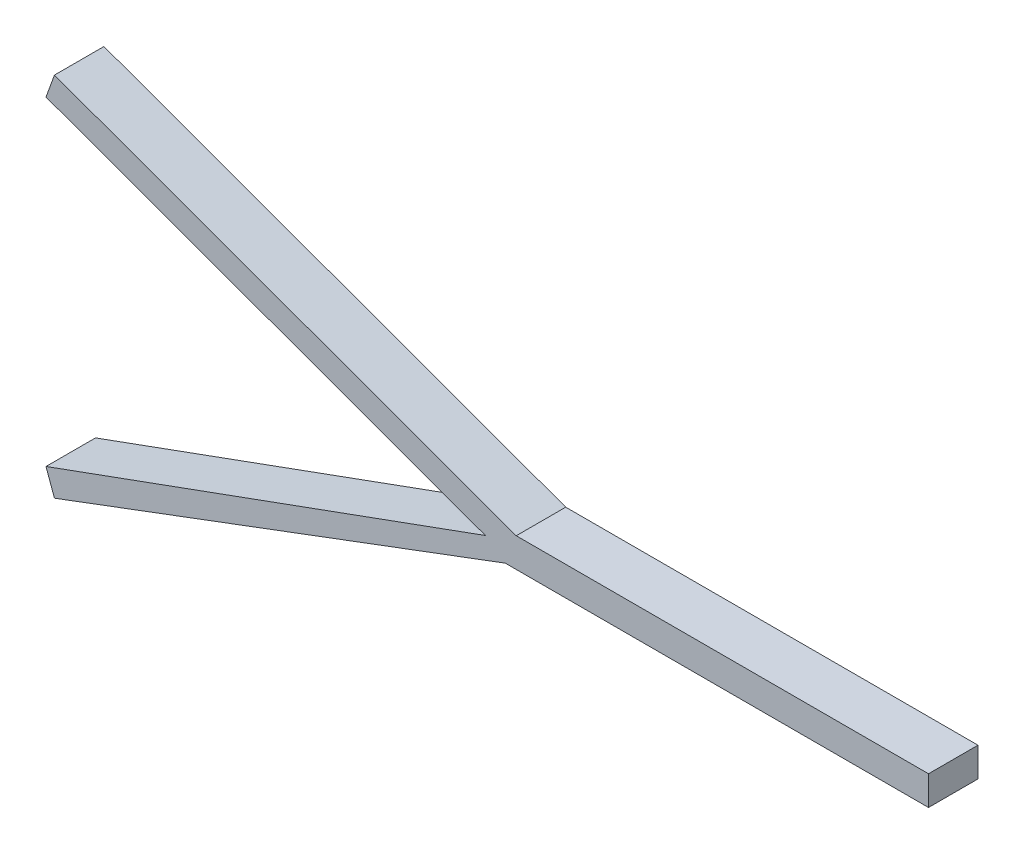
ISO-10303-21;
HEADER;
FILE_DESCRIPTION(('STEP AP214'),'2;1');
FILE_NAME('part.step','',(''),(''),'','','');
FILE_SCHEMA(('AUTOMOTIVE_DESIGN { 1 0 10303 214 1 1 1 1 }'));
ENDSEC;
DATA;
#1=APPLICATION_CONTEXT('core data for automotive mechanical design processes');
#2=APPLICATION_PROTOCOL_DEFINITION('international standard','automotive_design',2000,#1);
#3=PRODUCT_CONTEXT('',#1,'mechanical');
#4=PRODUCT('Part','Part','',(#3));
#5=PRODUCT_RELATED_PRODUCT_CATEGORY('part','',(#4));
#6=PRODUCT_DEFINITION_FORMATION('','',#4);
#7=PRODUCT_DEFINITION_CONTEXT('part definition',#1,'design');
#8=PRODUCT_DEFINITION('design','',#6,#7);
#9=PRODUCT_DEFINITION_SHAPE('','',#8);
#10=(LENGTH_UNIT() NAMED_UNIT(*) SI_UNIT(.MILLI.,.METRE.));
#11=(NAMED_UNIT(*) PLANE_ANGLE_UNIT() SI_UNIT($,.RADIAN.));
#12=(NAMED_UNIT(*) SI_UNIT($,.STERADIAN.) SOLID_ANGLE_UNIT());
#13=UNCERTAINTY_MEASURE_WITH_UNIT(LENGTH_MEASURE(1.E-05),#10,'distance_accuracy_value','');
#14=(GEOMETRIC_REPRESENTATION_CONTEXT(3) GLOBAL_UNCERTAINTY_ASSIGNED_CONTEXT((#13)) GLOBAL_UNIT_ASSIGNED_CONTEXT((#10,
#11,#12)) REPRESENTATION_CONTEXT('',''));
#15=CARTESIAN_POINT('',(0.,0.,0.));
#16=DIRECTION('',(0.,0.,1.));
#17=DIRECTION('',(1.,0.,0.));
#18=AXIS2_PLACEMENT_3D('',#15,#16,#17);
#19=CARTESIAN_POINT('',(-112.593637791252,45.0230125740432,10.));
#20=DIRECTION('',(0.93969262078591,-0.342020143325664,0.));
#21=DIRECTION('',(0.342020143325664,0.93969262078591,0.));
#22=AXIS2_PLACEMENT_3D('',#19,#20,#21);
#23=PLANE('',#22);
#24=DIRECTION('',(-0.342020143325664,-0.93969262078591,0.));
#25=VECTOR('',#24,1.);
#26=CARTESIAN_POINT('',(-112.593637791252,45.0230125740432,0.));
#27=LINE('',#26,#25);
#28=CARTESIAN_POINT('',(-112.593637791252,45.0230125740432,0.));
#29=VERTEX_POINT('',#28);
#30=CARTESIAN_POINT('',(-114.30373850788,40.3245494701136,0.));
#31=VERTEX_POINT('',#30);
#32=EDGE_CURVE('E146',#29,#31,#27,.T.);
#33=ORIENTED_EDGE('',*,*,#32,.T.);
#34=DIRECTION('',(0.,0.,-1.));
#35=VECTOR('',#34,1.);
#36=CARTESIAN_POINT('',(-114.30373850788,40.3245494701136,10.));
#37=LINE('',#36,#35);
#38=CARTESIAN_POINT('',(-114.30373850788,40.3245494701136,10.));
#39=VERTEX_POINT('',#38);
#40=EDGE_CURVE('E11',#39,#31,#37,.T.);
#41=ORIENTED_EDGE('',*,*,#40,.F.);
#42=DIRECTION('',(-0.342020143325664,-0.93969262078591,0.));
#43=VECTOR('',#42,1.);
#44=CARTESIAN_POINT('',(-112.593637791252,45.0230125740432,10.));
#45=LINE('',#44,#43);
#46=CARTESIAN_POINT('',(-112.593637791252,45.0230125740432,10.));
#47=VERTEX_POINT('',#46);
#48=EDGE_CURVE('E176',#47,#39,#45,.T.);
#49=ORIENTED_EDGE('',*,*,#48,.F.);
#50=DIRECTION('',(0.,0.,-1.));
#51=VECTOR('',#50,1.);
#52=CARTESIAN_POINT('',(-112.593637791252,45.0230125740432,10.));
#53=LINE('',#52,#51);
#54=EDGE_CURVE('E142',#47,#29,#53,.T.);
#55=ORIENTED_EDGE('',*,*,#54,.T.);
#56=EDGE_LOOP('',(#33,#41,#49,#55));
#57=FACE_BOUND('',#56,.T.);
#58=ADVANCED_FACE('F39',(#57),#23,.F.);
#59=CARTESIAN_POINT('',(-114.30373850788,40.3245494701136,10.));
#60=DIRECTION('',(0.342020143325663,0.939692620785911,0.));
#61=DIRECTION('',(-0.939692620785911,0.342020143325663,0.));
#62=AXIS2_PLACEMENT_3D('',#59,#60,#61);
#63=PLANE('',#62);
#64=DIRECTION('',(0.939692620785911,-0.342020143325663,0.));
#65=VECTOR('',#64,1.);
#66=CARTESIAN_POINT('',(-114.30373850788,40.3245494701136,0.));
#67=LINE('',#66,#65);
#68=CARTESIAN_POINT('',(-25.5005507087225,8.00283240326931,0.));
#69=VERTEX_POINT('',#68);
#70=EDGE_CURVE('E150',#31,#69,#67,.T.);
#71=ORIENTED_EDGE('',*,*,#70,.T.);
#72=DIRECTION('',(0.,0.,-1.));
#73=VECTOR('',#72,1.);
#74=CARTESIAN_POINT('',(-25.5005507087225,8.00283240326931,10.));
#75=LINE('',#74,#73);
#76=CARTESIAN_POINT('',(-25.5005507087225,8.00283240326931,10.));
#77=VERTEX_POINT('',#76);
#78=EDGE_CURVE('E48',#77,#69,#75,.T.);
#79=ORIENTED_EDGE('',*,*,#78,.F.);
#80=DIRECTION('',(0.939692620785911,-0.342020143325663,0.));
#81=VECTOR('',#80,1.);
#82=CARTESIAN_POINT('',(-114.30373850788,40.3245494701136,10.));
#83=LINE('',#82,#81);
#84=EDGE_CURVE('E98',#39,#77,#83,.T.);
#85=ORIENTED_EDGE('',*,*,#84,.F.);
#86=ORIENTED_EDGE('',*,*,#40,.T.);
#87=EDGE_LOOP('',(#71,#79,#85,#86));
#88=FACE_BOUND('',#87,.T.);
#89=ADVANCED_FACE('F198',(#88),#63,.F.);
#90=CARTESIAN_POINT('',(-114.30373850788,-24.318884663575,10.));
#91=DIRECTION('',(-0.342020143325663,0.93969262078591,0.));
#92=DIRECTION('',(-0.939692620785911,-0.342020143325663,0.));
#93=AXIS2_PLACEMENT_3D('',#90,#91,#92);
#94=PLANE('',#93);
#95=DIRECTION('',(0.939692620785911,0.342020143325663,0.));
#96=VECTOR('',#95,1.);
#97=CARTESIAN_POINT('',(-114.30373850788,-24.318884663575,0.));
#98=LINE('',#97,#96);
#99=CARTESIAN_POINT('',(-114.30373850788,-24.318884663575,0.));
#100=VERTEX_POINT('',#99);
#101=EDGE_CURVE('E154',#100,#69,#98,.T.);
#102=ORIENTED_EDGE('',*,*,#101,.F.);
#103=DIRECTION('',(0.,0.,-1.));
#104=VECTOR('',#103,1.);
#105=CARTESIAN_POINT('',(-114.30373850788,-24.318884663575,10.));
#106=LINE('',#105,#104);
#107=CARTESIAN_POINT('',(-114.30373850788,-24.318884663575,10.));
#108=VERTEX_POINT('',#107);
#109=EDGE_CURVE('E189',#108,#100,#106,.T.);
#110=ORIENTED_EDGE('',*,*,#109,.F.);
#111=DIRECTION('',(0.939692620785911,0.342020143325663,0.));
#112=VECTOR('',#111,1.);
#113=CARTESIAN_POINT('',(-114.30373850788,-24.318884663575,10.));
#114=LINE('',#113,#112);
#115=EDGE_CURVE('E197',#108,#77,#114,.T.);
#116=ORIENTED_EDGE('',*,*,#115,.T.);
#117=ORIENTED_EDGE('',*,*,#78,.T.);
#118=EDGE_LOOP('',(#102,#110,#116,#117));
#119=FACE_BOUND('',#118,.T.);
#120=ADVANCED_FACE('F195',(#119),#94,.T.);
#121=CARTESIAN_POINT('',(-112.593637791252,-29.0173477675046,10.));
#122=DIRECTION('',(-0.93969262078591,-0.342020143325664,0.));
#123=DIRECTION('',(0.342020143325664,-0.93969262078591,0.));
#124=AXIS2_PLACEMENT_3D('',#121,#122,#123);
#125=PLANE('',#124);
#126=DIRECTION('',(-0.342020143325664,0.93969262078591,0.));
#127=VECTOR('',#126,1.);
#128=CARTESIAN_POINT('',(-112.593637791252,-29.0173477675046,0.));
#129=LINE('',#128,#127);
#130=CARTESIAN_POINT('',(-112.593637791252,-29.0173477675046,0.));
#131=VERTEX_POINT('',#130);
#132=EDGE_CURVE('E158',#131,#100,#129,.T.);
#133=ORIENTED_EDGE('',*,*,#132,.F.);
#134=DIRECTION('',(0.,0.,-1.));
#135=VECTOR('',#134,1.);
#136=CARTESIAN_POINT('',(-112.593637791252,-29.0173477675046,10.));
#137=LINE('',#136,#135);
#138=CARTESIAN_POINT('',(-112.593637791252,-29.0173477675046,10.));
#139=VERTEX_POINT('',#138);
#140=EDGE_CURVE('E186',#139,#131,#137,.T.);
#141=ORIENTED_EDGE('',*,*,#140,.F.);
#142=DIRECTION('',(-0.342020143325664,0.93969262078591,0.));
#143=VECTOR('',#142,1.);
#144=CARTESIAN_POINT('',(-112.593637791252,-29.0173477675046,10.));
#145=LINE('',#144,#143);
#146=EDGE_CURVE('E210',#139,#108,#145,.T.);
#147=ORIENTED_EDGE('',*,*,#146,.T.);
#148=ORIENTED_EDGE('',*,*,#109,.T.);
#149=EDGE_LOOP('',(#133,#141,#147,#148));
#150=FACE_BOUND('',#149,.T.);
#151=ADVANCED_FACE('F207',(#150),#125,.T.);
#152=CARTESIAN_POINT('',(-21.4995863726403,5.15943840526074,10.));
#153=DIRECTION('',(0.351272269748519,-0.936273353516869,0.));
#154=DIRECTION('',(0.936273353516869,0.351272269748519,0.));
#155=AXIS2_PLACEMENT_3D('',#152,#153,#154);
#156=PLANE('',#155);
#157=DIRECTION('',(-0.936273353516869,-0.351272269748519,0.));
#158=VECTOR('',#157,1.);
#159=CARTESIAN_POINT('',(-21.4995863726403,5.15943840526074,0.));
#160=LINE('',#159,#158);
#161=CARTESIAN_POINT('',(-21.4995863726403,5.15943840526074,0.));
#162=VERTEX_POINT('',#161);
#163=EDGE_CURVE('E162',#162,#131,#160,.T.);
#164=ORIENTED_EDGE('',*,*,#163,.F.);
#165=DIRECTION('',(0.,0.,-1.));
#166=VECTOR('',#165,1.);
#167=CARTESIAN_POINT('',(-21.4995863726403,5.15943840526074,10.));
#168=LINE('',#167,#166);
#169=CARTESIAN_POINT('',(-21.4995863726403,5.15943840526074,10.));
#170=VERTEX_POINT('',#169);
#171=EDGE_CURVE('E183',#170,#162,#168,.T.);
#172=ORIENTED_EDGE('',*,*,#171,.F.);
#173=DIRECTION('',(-0.936273353516869,-0.351272269748519,0.));
#174=VECTOR('',#173,1.);
#175=CARTESIAN_POINT('',(-21.4995863726403,5.15943840526074,10.));
#176=LINE('',#175,#174);
#177=EDGE_CURVE('E216',#170,#139,#176,.T.);
#178=ORIENTED_EDGE('',*,*,#177,.T.);
#179=ORIENTED_EDGE('',*,*,#140,.T.);
#180=EDGE_LOOP('',(#164,#172,#178,#179));
#181=FACE_BOUND('',#180,.T.);
#182=ADVANCED_FACE('F224',(#181),#156,.T.);
#183=CARTESIAN_POINT('',(-21.4995863726403,5.15943840526074,10.));
#184=DIRECTION('',(0.,1.,0.));
#185=DIRECTION('',(-1.,0.,0.));
#186=AXIS2_PLACEMENT_3D('',#183,#184,#185);
#187=PLANE('',#186);
#188=DIRECTION('',(1.,0.,0.));
#189=VECTOR('',#188,1.);
#190=CARTESIAN_POINT('',(-21.4995863726403,5.15943840526074,0.));
#191=LINE('',#190,#189);
#192=CARTESIAN_POINT('',(64.0065631413396,5.15943840526074,0.));
#193=VERTEX_POINT('',#192);
#194=EDGE_CURVE('E166',#162,#193,#191,.T.);
#195=ORIENTED_EDGE('',*,*,#194,.T.);
#196=DIRECTION('',(0.,0.,-1.));
#197=VECTOR('',#196,1.);
#198=CARTESIAN_POINT('',(64.0065631413396,5.15943840526074,10.));
#199=LINE('',#198,#197);
#200=CARTESIAN_POINT('',(64.0065631413396,5.15943840526074,10.));
#201=VERTEX_POINT('',#200);
#202=EDGE_CURVE('E136',#201,#193,#199,.T.);
#203=ORIENTED_EDGE('',*,*,#202,.F.);
#204=DIRECTION('',(1.,0.,0.));
#205=VECTOR('',#204,1.);
#206=CARTESIAN_POINT('',(-21.4995863726403,5.15943840526074,10.));
#207=LINE('',#206,#205);
#208=EDGE_CURVE('E121',#170,#201,#207,.T.);
#209=ORIENTED_EDGE('',*,*,#208,.F.);
#210=ORIENTED_EDGE('',*,*,#171,.T.);
#211=EDGE_LOOP('',(#195,#203,#209,#210));
#212=FACE_BOUND('',#211,.T.);
#213=ADVANCED_FACE('F226',(#212),#187,.F.);
#214=CARTESIAN_POINT('',(64.0065631413396,5.15943840526074,10.));
#215=DIRECTION('',(-1.,0.,0.));
#216=DIRECTION('',(0.,0.,1.));
#217=AXIS2_PLACEMENT_3D('',#214,#215,#216);
#218=PLANE('',#217);
#219=DIRECTION('',(0.,1.,0.));
#220=VECTOR('',#219,1.);
#221=CARTESIAN_POINT('',(64.0065631413396,5.15943840526074,0.));
#222=LINE('',#221,#220);
#223=CARTESIAN_POINT('',(64.0065631413396,11.0645165835248,0.));
#224=VERTEX_POINT('',#223);
#225=EDGE_CURVE('E131',#193,#224,#222,.T.);
#226=ORIENTED_EDGE('',*,*,#225,.T.);
#227=DIRECTION('',(0.,0.,-1.));
#228=VECTOR('',#227,1.);
#229=CARTESIAN_POINT('',(64.0065631413396,11.0645165835248,10.));
#230=LINE('',#229,#228);
#231=CARTESIAN_POINT('',(64.0065631413396,11.0645165835248,10.));
#232=VERTEX_POINT('',#231);
#233=EDGE_CURVE('E128',#232,#224,#230,.T.);
#234=ORIENTED_EDGE('',*,*,#233,.F.);
#235=DIRECTION('',(0.,1.,0.));
#236=VECTOR('',#235,1.);
#237=CARTESIAN_POINT('',(64.0065631413396,5.15943840526074,10.));
#238=LINE('',#237,#236);
#239=EDGE_CURVE('E114',#201,#232,#238,.T.);
#240=ORIENTED_EDGE('',*,*,#239,.F.);
#241=ORIENTED_EDGE('',*,*,#202,.T.);
#242=EDGE_LOOP('',(#226,#234,#240,#241));
#243=FACE_BOUND('',#242,.T.);
#244=ADVANCED_FACE('F129',(#243),#218,.F.);
#245=CARTESIAN_POINT('',(-19.2934368586604,11.0645165835248,10.));
#246=DIRECTION('',(0.,1.,0.));
#247=DIRECTION('',(-1.,0.,0.));
#248=AXIS2_PLACEMENT_3D('',#245,#246,#247);
#249=PLANE('',#248);
#250=DIRECTION('',(1.,0.,0.));
#251=VECTOR('',#250,1.);
#252=CARTESIAN_POINT('',(-19.2934368586604,11.0645165835248,0.));
#253=LINE('',#252,#251);
#254=CARTESIAN_POINT('',(-19.2934368586604,11.0645165835248,0.));
#255=VERTEX_POINT('',#254);
#256=EDGE_CURVE('E171',#255,#224,#253,.T.);
#257=ORIENTED_EDGE('',*,*,#256,.F.);
#258=DIRECTION('',(0.,0.,-1.));
#259=VECTOR('',#258,1.);
#260=CARTESIAN_POINT('',(-19.2934368586604,11.0645165835248,10.));
#261=LINE('',#260,#259);
#262=CARTESIAN_POINT('',(-19.2934368586604,11.0645165835248,10.));
#263=VERTEX_POINT('',#262);
#264=EDGE_CURVE('E87',#263,#255,#261,.T.);
#265=ORIENTED_EDGE('',*,*,#264,.F.);
#266=DIRECTION('',(1.,0.,0.));
#267=VECTOR('',#266,1.);
#268=CARTESIAN_POINT('',(-19.2934368586604,11.0645165835248,10.));
#269=LINE('',#268,#267);
#270=EDGE_CURVE('E118',#263,#232,#269,.T.);
#271=ORIENTED_EDGE('',*,*,#270,.T.);
#272=ORIENTED_EDGE('',*,*,#233,.T.);
#273=EDGE_LOOP('',(#257,#265,#271,#272));
#274=FACE_BOUND('',#273,.T.);
#275=ADVANCED_FACE('F138',(#274),#249,.T.);
#276=CARTESIAN_POINT('',(-19.2934368586604,11.0645165835248,10.));
#277=DIRECTION('',(-0.342020143325663,-0.939692620785911,0.));
#278=DIRECTION('',(0.939692620785911,-0.342020143325663,0.));
#279=AXIS2_PLACEMENT_3D('',#276,#277,#278);
#280=PLANE('',#279);
#281=DIRECTION('',(-0.939692620785911,0.342020143325663,0.));
#282=VECTOR('',#281,1.);
#283=CARTESIAN_POINT('',(-19.2934368586604,11.0645165835248,0.));
#284=LINE('',#283,#282);
#285=EDGE_CURVE('E90',#255,#29,#284,.T.);
#286=ORIENTED_EDGE('',*,*,#285,.T.);
#287=ORIENTED_EDGE('',*,*,#54,.F.);
#288=DIRECTION('',(-0.939692620785911,0.342020143325663,0.));
#289=VECTOR('',#288,1.);
#290=CARTESIAN_POINT('',(-19.2934368586604,11.0645165835248,10.));
#291=LINE('',#290,#289);
#292=EDGE_CURVE('E56',#263,#47,#291,.T.);
#293=ORIENTED_EDGE('',*,*,#292,.F.);
#294=ORIENTED_EDGE('',*,*,#264,.T.);
#295=EDGE_LOOP('',(#286,#287,#293,#294));
#296=FACE_BOUND('',#295,.T.);
#297=ADVANCED_FACE('F229',(#296),#280,.F.);
#298=CARTESIAN_POINT('',(0.,0.,10.));
#299=DIRECTION('',(0.,0.,1.));
#300=DIRECTION('',(1.,0.,0.));
#301=AXIS2_PLACEMENT_3D('',#298,#299,#300);
#302=PLANE('',#301);
#303=ORIENTED_EDGE('',*,*,#48,.T.);
#304=ORIENTED_EDGE('',*,*,#84,.T.);
#305=ORIENTED_EDGE('',*,*,#115,.F.);
#306=ORIENTED_EDGE('',*,*,#146,.F.);
#307=ORIENTED_EDGE('',*,*,#177,.F.);
#308=ORIENTED_EDGE('',*,*,#208,.T.);
#309=ORIENTED_EDGE('',*,*,#239,.T.);
#310=ORIENTED_EDGE('',*,*,#270,.F.);
#311=ORIENTED_EDGE('',*,*,#292,.T.);
#312=EDGE_LOOP('',(#303,#304,#305,#306,#307,#308,#309,#310,#311));
#313=FACE_BOUND('',#312,.T.);
#314=ADVANCED_FACE('F116',(#313),#302,.T.);
#315=CARTESIAN_POINT('',(0.,0.,0.));
#316=DIRECTION('',(0.,0.,1.));
#317=DIRECTION('',(1.,0.,0.));
#318=AXIS2_PLACEMENT_3D('',#315,#316,#317);
#319=PLANE('',#318);
#320=ORIENTED_EDGE('',*,*,#32,.F.);
#321=ORIENTED_EDGE('',*,*,#285,.F.);
#322=ORIENTED_EDGE('',*,*,#256,.T.);
#323=ORIENTED_EDGE('',*,*,#225,.F.);
#324=ORIENTED_EDGE('',*,*,#194,.F.);
#325=ORIENTED_EDGE('',*,*,#163,.T.);
#326=ORIENTED_EDGE('',*,*,#132,.T.);
#327=ORIENTED_EDGE('',*,*,#101,.T.);
#328=ORIENTED_EDGE('',*,*,#70,.F.);
#329=EDGE_LOOP('',(#320,#321,#322,#323,#324,#325,#326,#327,#328));
#330=FACE_BOUND('',#329,.T.);
#331=ADVANCED_FACE('F202',(#330),#319,.F.);
#332=CLOSED_SHELL('',(#58,#89,#120,#151,#182,#213,#244,#275,#297,#314,#331));
#333=MANIFOLD_SOLID_BREP('B2',#332);
#334=ADVANCED_BREP_SHAPE_REPRESENTATION('',(#18,#333),#14);
#335=SHAPE_DEFINITION_REPRESENTATION(#9,#334);
ENDSEC;
END-ISO-10303-21;
